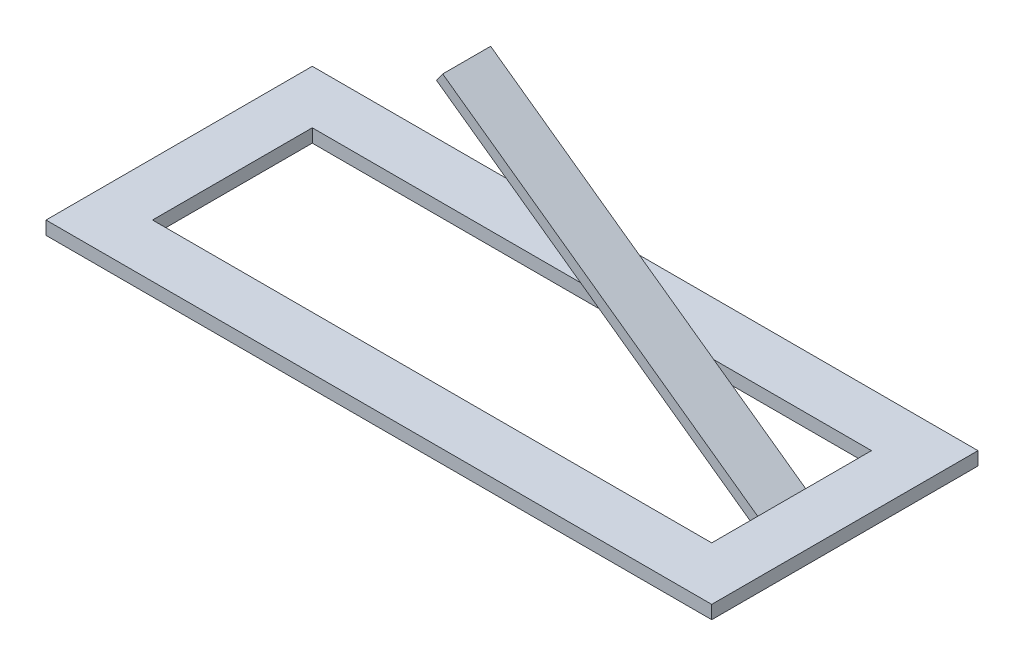
ISO-10303-21;
HEADER;
FILE_DESCRIPTION(('STEP AP214'),'2;1');
FILE_NAME('part.step','',(''),(''),'','','');
FILE_SCHEMA(('AUTOMOTIVE_DESIGN { 1 0 10303 214 1 1 1 1 }'));
ENDSEC;
DATA;
#1=APPLICATION_CONTEXT('core data for automotive mechanical design processes');
#2=APPLICATION_PROTOCOL_DEFINITION('international standard','automotive_design',2000,#1);
#3=PRODUCT_CONTEXT('',#1,'mechanical');
#4=PRODUCT('Part','Part','',(#3));
#5=PRODUCT_RELATED_PRODUCT_CATEGORY('part','',(#4));
#6=PRODUCT_DEFINITION_FORMATION('','',#4);
#7=PRODUCT_DEFINITION_CONTEXT('part definition',#1,'design');
#8=PRODUCT_DEFINITION('design','',#6,#7);
#9=PRODUCT_DEFINITION_SHAPE('','',#8);
#10=(LENGTH_UNIT() NAMED_UNIT(*) SI_UNIT(.MILLI.,.METRE.));
#11=(NAMED_UNIT(*) PLANE_ANGLE_UNIT() SI_UNIT($,.RADIAN.));
#12=(NAMED_UNIT(*) SI_UNIT($,.STERADIAN.) SOLID_ANGLE_UNIT());
#13=UNCERTAINTY_MEASURE_WITH_UNIT(LENGTH_MEASURE(1.E-05),#10,'distance_accuracy_value','');
#14=(GEOMETRIC_REPRESENTATION_CONTEXT(3) GLOBAL_UNCERTAINTY_ASSIGNED_CONTEXT((#13)) GLOBAL_UNIT_ASSIGNED_CONTEXT((#10,
#11,#12)) REPRESENTATION_CONTEXT('',''));
#15=CARTESIAN_POINT('',(0.,0.,0.));
#16=DIRECTION('',(0.,0.,1.));
#17=DIRECTION('',(1.,0.,0.));
#18=AXIS2_PLACEMENT_3D('',#15,#16,#17);
#19=CARTESIAN_POINT('',(-83.7777777777778,10.,0.));
#20=DIRECTION('',(1.,0.,0.));
#21=DIRECTION('',(0.,0.,-1.));
#22=AXIS2_PLACEMENT_3D('',#19,#20,#21);
#23=PLANE('',#22);
#24=DIRECTION('',(0.,0.,1.));
#25=VECTOR('',#24,1.);
#26=CARTESIAN_POINT('',(-83.7777777777778,5.,-117.));
#27=LINE('',#26,#25);
#28=CARTESIAN_POINT('',(-83.7777777777778,5.,-80.));
#29=VERTEX_POINT('',#28);
#30=CARTESIAN_POINT('',(-83.7777777777778,5.,20.));
#31=VERTEX_POINT('',#30);
#32=EDGE_CURVE('E58',#29,#31,#27,.T.);
#33=ORIENTED_EDGE('',*,*,#32,.T.);
#34=DIRECTION('',(0.,-1.,0.));
#35=VECTOR('',#34,1.);
#36=CARTESIAN_POINT('',(-83.7777777777778,10.,20.));
#37=LINE('',#36,#35);
#38=CARTESIAN_POINT('',(-83.7777777777778,10.,20.));
#39=VERTEX_POINT('',#38);
#40=EDGE_CURVE('E151',#39,#31,#37,.T.);
#41=ORIENTED_EDGE('',*,*,#40,.F.);
#42=DIRECTION('',(0.,0.,1.));
#43=VECTOR('',#42,1.);
#44=CARTESIAN_POINT('',(-83.7777777777778,10.,0.));
#45=LINE('',#44,#43);
#46=CARTESIAN_POINT('',(-83.7777777777778,10.,-80.));
#47=VERTEX_POINT('',#46);
#48=EDGE_CURVE('E217',#47,#39,#45,.T.);
#49=ORIENTED_EDGE('',*,*,#48,.F.);
#50=DIRECTION('',(0.,-1.,0.));
#51=VECTOR('',#50,1.);
#52=CARTESIAN_POINT('',(-83.7777777777778,10.,-80.));
#53=LINE('',#52,#51);
#54=EDGE_CURVE('E160',#47,#29,#53,.T.);
#55=ORIENTED_EDGE('',*,*,#54,.T.);
#56=EDGE_LOOP('',(#33,#41,#49,#55));
#57=FACE_BOUND('',#56,.T.);
#58=ADVANCED_FACE('F43',(#57),#23,.F.);
#59=CARTESIAN_POINT('',(0.,10.,20.));
#60=DIRECTION('',(0.,0.,-1.));
#61=DIRECTION('',(-1.,0.,0.));
#62=AXIS2_PLACEMENT_3D('',#59,#60,#61);
#63=PLANE('',#62);
#64=DIRECTION('',(1.,0.,0.));
#65=VECTOR('',#64,1.);
#66=CARTESIAN_POINT('',(-83.7777777777778,5.,20.));
#67=LINE('',#66,#65);
#68=CARTESIAN_POINT('',(166.222222222222,5.,20.));
#69=VERTEX_POINT('',#68);
#70=EDGE_CURVE('E138',#31,#69,#67,.T.);
#71=ORIENTED_EDGE('',*,*,#70,.T.);
#72=DIRECTION('',(0.,-1.,0.));
#73=VECTOR('',#72,1.);
#74=CARTESIAN_POINT('',(166.222222222222,10.,20.));
#75=LINE('',#74,#73);
#76=CARTESIAN_POINT('',(166.222222222222,10.,20.));
#77=VERTEX_POINT('',#76);
#78=EDGE_CURVE('E148',#77,#69,#75,.T.);
#79=ORIENTED_EDGE('',*,*,#78,.F.);
#80=DIRECTION('',(1.,0.,0.));
#81=VECTOR('',#80,1.);
#82=CARTESIAN_POINT('',(0.,10.,20.));
#83=LINE('',#82,#81);
#84=EDGE_CURVE('E220',#39,#77,#83,.T.);
#85=ORIENTED_EDGE('',*,*,#84,.F.);
#86=ORIENTED_EDGE('',*,*,#40,.T.);
#87=EDGE_LOOP('',(#71,#79,#85,#86));
#88=FACE_BOUND('',#87,.T.);
#89=ADVANCED_FACE('F147',(#88),#63,.F.);
#90=CARTESIAN_POINT('',(166.222222222222,10.,0.));
#91=DIRECTION('',(1.,0.,0.));
#92=DIRECTION('',(0.,0.,-1.));
#93=AXIS2_PLACEMENT_3D('',#90,#91,#92);
#94=PLANE('',#93);
#95=ORIENTED_EDGE('',*,*,#78,.T.);
#96=DIRECTION('',(0.,0.,1.));
#97=VECTOR('',#96,1.);
#98=CARTESIAN_POINT('',(166.222222222222,5.,-117.));
#99=LINE('',#98,#97);
#100=CARTESIAN_POINT('',(166.222222222222,5.,-80.));
#101=VERTEX_POINT('',#100);
#102=EDGE_CURVE('E135',#101,#69,#99,.T.);
#103=ORIENTED_EDGE('',*,*,#102,.F.);
#104=DIRECTION('',(0.,-1.,0.));
#105=VECTOR('',#104,1.);
#106=CARTESIAN_POINT('',(166.222222222222,10.,-80.));
#107=LINE('',#106,#105);
#108=CARTESIAN_POINT('',(166.222222222222,10.,-80.));
#109=VERTEX_POINT('',#108);
#110=EDGE_CURVE('E156',#109,#101,#107,.T.);
#111=ORIENTED_EDGE('',*,*,#110,.F.);
#112=DIRECTION('',(0.,0.,1.));
#113=VECTOR('',#112,1.);
#114=CARTESIAN_POINT('',(166.222222222222,10.,0.));
#115=LINE('',#114,#113);
#116=EDGE_CURVE('E155',#109,#77,#115,.T.);
#117=ORIENTED_EDGE('',*,*,#116,.T.);
#118=EDGE_LOOP('',(#95,#103,#111,#117));
#119=FACE_BOUND('',#118,.T.);
#120=ADVANCED_FACE('F153',(#119),#94,.T.);
#121=CARTESIAN_POINT('',(0.,10.,0.));
#122=DIRECTION('',(0.,0.,1.));
#123=DIRECTION('',(1.,0.,0.));
#124=AXIS2_PLACEMENT_3D('',#121,#122,#123);
#125=PLANE('',#124);
#126=DIRECTION('',(1.,0.,0.));
#127=VECTOR('',#126,1.);
#128=CARTESIAN_POINT('',(0.,5.,0.));
#129=LINE('',#128,#127);
#130=CARTESIAN_POINT('',(-63.7777777777778,5.,0.));
#131=VERTEX_POINT('',#130);
#132=CARTESIAN_POINT('',(146.222222222222,5.,0.));
#133=VERTEX_POINT('',#132);
#134=EDGE_CURVE('E231',#131,#133,#129,.T.);
#135=ORIENTED_EDGE('',*,*,#134,.F.);
#136=DIRECTION('',(0.,-1.,0.));
#137=VECTOR('',#136,1.);
#138=CARTESIAN_POINT('',(-63.7777777777778,10.,0.));
#139=LINE('',#138,#137);
#140=CARTESIAN_POINT('',(-63.7777777777778,10.,0.));
#141=VERTEX_POINT('',#140);
#142=EDGE_CURVE('E174',#141,#131,#139,.T.);
#143=ORIENTED_EDGE('',*,*,#142,.F.);
#144=DIRECTION('',(-1.,0.,0.));
#145=VECTOR('',#144,1.);
#146=CARTESIAN_POINT('',(0.,10.,0.));
#147=LINE('',#146,#145);
#148=CARTESIAN_POINT('',(146.222222222222,10.,0.));
#149=VERTEX_POINT('',#148);
#150=EDGE_CURVE('E207',#149,#141,#147,.T.);
#151=ORIENTED_EDGE('',*,*,#150,.F.);
#152=DIRECTION('',(0.,-1.,0.));
#153=VECTOR('',#152,1.);
#154=CARTESIAN_POINT('',(146.222222222222,10.,0.));
#155=LINE('',#154,#153);
#156=EDGE_CURVE('E164',#149,#133,#155,.T.);
#157=ORIENTED_EDGE('',*,*,#156,.T.);
#158=EDGE_LOOP('',(#135,#143,#151,#157));
#159=FACE_BOUND('',#158,.T.);
#160=ADVANCED_FACE('F45',(#159),#125,.F.);
#161=CARTESIAN_POINT('',(-63.7777777777778,10.,0.));
#162=DIRECTION('',(1.,0.,0.));
#163=DIRECTION('',(0.,0.,-1.));
#164=AXIS2_PLACEMENT_3D('',#161,#162,#163);
#165=PLANE('',#164);
#166=ORIENTED_EDGE('',*,*,#142,.T.);
#167=DIRECTION('',(0.,0.,-1.));
#168=VECTOR('',#167,1.);
#169=CARTESIAN_POINT('',(-63.7777777777778,5.,0.));
#170=LINE('',#169,#168);
#171=CARTESIAN_POINT('',(-63.7777777777778,5.,-60.0000000000002));
#172=VERTEX_POINT('',#171);
#173=EDGE_CURVE('E234',#131,#172,#170,.T.);
#174=ORIENTED_EDGE('',*,*,#173,.T.);
#175=DIRECTION('',(0.,-1.,0.));
#176=VECTOR('',#175,1.);
#177=CARTESIAN_POINT('',(-63.7777777777778,10.,-60.0000000000001));
#178=LINE('',#177,#176);
#179=CARTESIAN_POINT('',(-63.7777777777778,10.,-60.0000000000001));
#180=VERTEX_POINT('',#179);
#181=EDGE_CURVE('E171',#180,#172,#178,.T.);
#182=ORIENTED_EDGE('',*,*,#181,.F.);
#183=DIRECTION('',(0.,0.,1.));
#184=VECTOR('',#183,1.);
#185=CARTESIAN_POINT('',(-63.7777777777778,10.,0.));
#186=LINE('',#185,#184);
#187=EDGE_CURVE('E209',#180,#141,#186,.T.);
#188=ORIENTED_EDGE('',*,*,#187,.T.);
#189=EDGE_LOOP('',(#166,#174,#182,#188));
#190=FACE_BOUND('',#189,.T.);
#191=ADVANCED_FACE('F268',(#190),#165,.T.);
#192=CARTESIAN_POINT('',(0.,10.,-60.0000000000001));
#193=DIRECTION('',(0.,0.,1.));
#194=DIRECTION('',(1.,0.,0.));
#195=AXIS2_PLACEMENT_3D('',#192,#193,#194);
#196=PLANE('',#195);
#197=ORIENTED_EDGE('',*,*,#181,.T.);
#198=DIRECTION('',(1.,0.,0.));
#199=VECTOR('',#198,1.);
#200=CARTESIAN_POINT('',(0.,5.,-60.0000000000001));
#201=LINE('',#200,#199);
#202=CARTESIAN_POINT('',(146.222222222222,5.,-60.));
#203=VERTEX_POINT('',#202);
#204=EDGE_CURVE('E262',#172,#203,#201,.T.);
#205=ORIENTED_EDGE('',*,*,#204,.T.);
#206=DIRECTION('',(0.,-1.,0.));
#207=VECTOR('',#206,1.);
#208=CARTESIAN_POINT('',(146.222222222222,10.,-60.));
#209=LINE('',#208,#207);
#210=CARTESIAN_POINT('',(146.222222222222,10.,-60.));
#211=VERTEX_POINT('',#210);
#212=EDGE_CURVE('E167',#211,#203,#209,.T.);
#213=ORIENTED_EDGE('',*,*,#212,.F.);
#214=DIRECTION('',(-1.,0.,0.));
#215=VECTOR('',#214,1.);
#216=CARTESIAN_POINT('',(0.,10.,-60.0000000000001));
#217=LINE('',#216,#215);
#218=EDGE_CURVE('E212',#211,#180,#217,.T.);
#219=ORIENTED_EDGE('',*,*,#218,.T.);
#220=EDGE_LOOP('',(#197,#205,#213,#219));
#221=FACE_BOUND('',#220,.T.);
#222=ADVANCED_FACE('F273',(#221),#196,.T.);
#223=CARTESIAN_POINT('',(146.222222222222,10.,0.));
#224=DIRECTION('',(1.,0.,0.));
#225=DIRECTION('',(0.,0.,-1.));
#226=AXIS2_PLACEMENT_3D('',#223,#224,#225);
#227=PLANE('',#226);
#228=DIRECTION('',(0.,0.,-1.));
#229=VECTOR('',#228,1.);
#230=CARTESIAN_POINT('',(146.222222222222,5.,0.));
#231=LINE('',#230,#229);
#232=CARTESIAN_POINT('',(146.222222222222,5.,-18.));
#233=VERTEX_POINT('',#232);
#234=EDGE_CURVE('E66',#133,#233,#231,.T.);
#235=ORIENTED_EDGE('',*,*,#234,.F.);
#236=ORIENTED_EDGE('',*,*,#156,.F.);
#237=DIRECTION('',(0.,0.,1.));
#238=VECTOR('',#237,1.);
#239=CARTESIAN_POINT('',(146.222222222222,10.,0.));
#240=LINE('',#239,#238);
#241=EDGE_CURVE('E215',#211,#149,#240,.T.);
#242=ORIENTED_EDGE('',*,*,#241,.F.);
#243=ORIENTED_EDGE('',*,*,#212,.T.);
#244=CARTESIAN_POINT('',(146.222222222222,5.,-36.));
#245=VERTEX_POINT('',#244);
#246=EDGE_CURVE('E258',#245,#203,#231,.T.);
#247=ORIENTED_EDGE('',*,*,#246,.F.);
#248=DIRECTION('',(0.,1.,0.));
#249=VECTOR('',#248,1.);
#250=CARTESIAN_POINT('',(146.222222222222,10.,-36.));
#251=LINE('',#250,#249);
#252=CARTESIAN_POINT('',(146.222222222222,8.77207494611245,-36.));
#253=VERTEX_POINT('',#252);
#254=EDGE_CURVE('E158',#245,#253,#251,.T.);
#255=ORIENTED_EDGE('',*,*,#254,.T.);
#256=DIRECTION('',(0.,0.,1.));
#257=VECTOR('',#256,1.);
#258=CARTESIAN_POINT('',(146.222222222222,8.77207494611245,0.));
#259=LINE('',#258,#257);
#260=CARTESIAN_POINT('',(146.222222222222,8.77207494611245,-18.));
#261=VERTEX_POINT('',#260);
#262=EDGE_CURVE('E200',#253,#261,#259,.T.);
#263=ORIENTED_EDGE('',*,*,#262,.T.);
#264=DIRECTION('',(0.,1.,0.));
#265=VECTOR('',#264,1.);
#266=CARTESIAN_POINT('',(146.222222222222,-36.,-18.));
#267=LINE('',#266,#265);
#268=EDGE_CURVE('E230',#233,#261,#267,.T.);
#269=ORIENTED_EDGE('',*,*,#268,.F.);
#270=EDGE_LOOP('',(#235,#236,#242,#243,#247,#255,#263,#269));
#271=FACE_BOUND('',#270,.T.);
#272=ADVANCED_FACE('F255',(#271),#227,.F.);
#273=CARTESIAN_POINT('',(0.,10.,-80.));
#274=DIRECTION('',(0.,0.,-1.));
#275=DIRECTION('',(-1.,0.,0.));
#276=AXIS2_PLACEMENT_3D('',#273,#274,#275);
#277=PLANE('',#276);
#278=ORIENTED_EDGE('',*,*,#110,.T.);
#279=DIRECTION('',(-1.,0.,0.));
#280=VECTOR('',#279,1.);
#281=CARTESIAN_POINT('',(0.,5.,-80.));
#282=LINE('',#281,#280);
#283=EDGE_CURVE('E139',#101,#29,#282,.T.);
#284=ORIENTED_EDGE('',*,*,#283,.T.);
#285=ORIENTED_EDGE('',*,*,#54,.F.);
#286=DIRECTION('',(1.,0.,0.));
#287=VECTOR('',#286,1.);
#288=CARTESIAN_POINT('',(0.,10.,-80.));
#289=LINE('',#288,#287);
#290=EDGE_CURVE('E168',#47,#109,#289,.T.);
#291=ORIENTED_EDGE('',*,*,#290,.T.);
#292=EDGE_LOOP('',(#278,#284,#285,#291));
#293=FACE_BOUND('',#292,.T.);
#294=ADVANCED_FACE('F229',(#293),#277,.T.);
#295=CARTESIAN_POINT('',(0.,0.,-36.));
#296=DIRECTION('',(0.,0.,-1.));
#297=DIRECTION('',(-1.,0.,0.));
#298=AXIS2_PLACEMENT_3D('',#295,#296,#297);
#299=PLANE('',#298);
#300=ORIENTED_EDGE('',*,*,#254,.F.);
#301=DIRECTION('',(-1.,0.,0.));
#302=VECTOR('',#301,1.);
#303=CARTESIAN_POINT('',(0.,5.,-36.));
#304=LINE('',#303,#302);
#305=CARTESIAN_POINT('',(144.619477723049,5.00000000000002,-36.));
#306=VERTEX_POINT('',#305);
#307=EDGE_CURVE('E247',#245,#306,#304,.T.);
#308=ORIENTED_EDGE('',*,*,#307,.T.);
#309=DIRECTION('',(0.813054204662094,-0.582187993934339,0.));
#310=VECTOR('',#309,1.);
#311=CARTESIAN_POINT('',(24.8696626536189,90.7469332419899,-36.));
#312=LINE('',#311,#310);
#313=CARTESIAN_POINT('',(24.8696626536189,90.7469332419899,-36.));
#314=VERTEX_POINT('',#313);
#315=EDGE_CURVE('E198',#314,#306,#312,.T.);
#316=ORIENTED_EDGE('',*,*,#315,.F.);
#317=DIRECTION('',(-0.582187993934339,-0.813054204662094,0.));
#318=VECTOR('',#317,1.);
#319=CARTESIAN_POINT('',(27.1984146293562,93.9991500606383,-36.));
#320=LINE('',#319,#318);
#321=CARTESIAN_POINT('',(27.1984146293562,93.9991500606383,-36.));
#322=VERTEX_POINT('',#321);
#323=EDGE_CURVE('E203',#322,#314,#320,.T.);
#324=ORIENTED_EDGE('',*,*,#323,.F.);
#325=DIRECTION('',(-0.813054204662094,0.582187993934339,0.));
#326=VECTOR('',#325,1.);
#327=CARTESIAN_POINT('',(155.307951764649,2.26623237693957,-36.));
#328=LINE('',#327,#326);
#329=EDGE_CURVE('E197',#253,#322,#328,.T.);
#330=ORIENTED_EDGE('',*,*,#329,.F.);
#331=EDGE_LOOP('',(#300,#308,#316,#324,#330));
#332=FACE_BOUND('',#331,.T.);
#333=ADVANCED_FACE('F246',(#332),#299,.T.);
#334=CARTESIAN_POINT('',(24.8696626536189,90.7469332419899,-36.));
#335=DIRECTION('',(-0.582187993934339,-0.813054204662094,0.));
#336=DIRECTION('',(0.813054204662094,-0.582187993934339,0.));
#337=AXIS2_PLACEMENT_3D('',#334,#335,#336);
#338=PLANE('',#337);
#339=ORIENTED_EDGE('',*,*,#315,.T.);
#340=DIRECTION('',(0.,0.,1.));
#341=VECTOR('',#340,1.);
#342=CARTESIAN_POINT('',(144.619477723049,5.00000000000002,-36.));
#343=LINE('',#342,#341);
#344=CARTESIAN_POINT('',(144.619477723049,5.00000000000001,-18.));
#345=VERTEX_POINT('',#344);
#346=EDGE_CURVE('E251',#306,#345,#343,.T.);
#347=ORIENTED_EDGE('',*,*,#346,.T.);
#348=DIRECTION('',(-0.813054204662094,0.582187993934339,0.));
#349=VECTOR('',#348,1.);
#350=CARTESIAN_POINT('',(24.8696626536189,90.7469332419899,-18.));
#351=LINE('',#350,#349);
#352=CARTESIAN_POINT('',(24.8696626536189,90.7469332419899,-18.));
#353=VERTEX_POINT('',#352);
#354=EDGE_CURVE('E239',#345,#353,#351,.T.);
#355=ORIENTED_EDGE('',*,*,#354,.T.);
#356=DIRECTION('',(0.,0.,1.));
#357=VECTOR('',#356,1.);
#358=CARTESIAN_POINT('',(24.8696626536189,90.7469332419899,-36.));
#359=LINE('',#358,#357);
#360=EDGE_CURVE('E187',#314,#353,#359,.T.);
#361=ORIENTED_EDGE('',*,*,#360,.F.);
#362=EDGE_LOOP('',(#339,#347,#355,#361));
#363=FACE_BOUND('',#362,.T.);
#364=ADVANCED_FACE('F250',(#363),#338,.T.);
#365=CARTESIAN_POINT('',(0.,0.,-18.));
#366=DIRECTION('',(0.,0.,1.));
#367=DIRECTION('',(1.,0.,0.));
#368=AXIS2_PLACEMENT_3D('',#365,#366,#367);
#369=PLANE('',#368);
#370=ORIENTED_EDGE('',*,*,#354,.F.);
#371=DIRECTION('',(1.,0.,0.));
#372=VECTOR('',#371,1.);
#373=CARTESIAN_POINT('',(0.,5.,-18.));
#374=LINE('',#373,#372);
#375=EDGE_CURVE('E11',#345,#233,#374,.T.);
#376=ORIENTED_EDGE('',*,*,#375,.T.);
#377=ORIENTED_EDGE('',*,*,#268,.T.);
#378=DIRECTION('',(0.813054204662094,-0.582187993934339,0.));
#379=VECTOR('',#378,1.);
#380=CARTESIAN_POINT('',(155.307951764649,2.26623237693957,-18.));
#381=LINE('',#380,#379);
#382=CARTESIAN_POINT('',(27.1984146293562,93.9991500606383,-18.));
#383=VERTEX_POINT('',#382);
#384=EDGE_CURVE('E194',#383,#261,#381,.T.);
#385=ORIENTED_EDGE('',*,*,#384,.F.);
#386=DIRECTION('',(0.582187993934339,0.813054204662094,0.));
#387=VECTOR('',#386,1.);
#388=CARTESIAN_POINT('',(27.1984146293562,93.9991500606383,-18.));
#389=LINE('',#388,#387);
#390=EDGE_CURVE('E51',#353,#383,#389,.T.);
#391=ORIENTED_EDGE('',*,*,#390,.F.);
#392=EDGE_LOOP('',(#370,#376,#377,#385,#391));
#393=FACE_BOUND('',#392,.T.);
#394=ADVANCED_FACE('F252',(#393),#369,.T.);
#395=CARTESIAN_POINT('',(27.1984146293562,93.9991500606383,-36.));
#396=DIRECTION('',(-0.813054204662094,0.582187993934339,0.));
#397=DIRECTION('',(-0.582187993934339,-0.813054204662094,0.));
#398=AXIS2_PLACEMENT_3D('',#395,#396,#397);
#399=PLANE('',#398);
#400=ORIENTED_EDGE('',*,*,#360,.T.);
#401=ORIENTED_EDGE('',*,*,#390,.T.);
#402=DIRECTION('',(0.,0.,1.));
#403=VECTOR('',#402,1.);
#404=CARTESIAN_POINT('',(27.1984146293562,93.9991500606383,-36.));
#405=LINE('',#404,#403);
#406=EDGE_CURVE('E185',#322,#383,#405,.T.);
#407=ORIENTED_EDGE('',*,*,#406,.F.);
#408=ORIENTED_EDGE('',*,*,#323,.T.);
#409=EDGE_LOOP('',(#400,#401,#407,#408));
#410=FACE_BOUND('',#409,.T.);
#411=ADVANCED_FACE('F183',(#410),#399,.T.);
#412=CARTESIAN_POINT('',(0.,10.,0.));
#413=DIRECTION('',(0.,1.,0.));
#414=DIRECTION('',(0.,0.,1.));
#415=AXIS2_PLACEMENT_3D('',#412,#413,#414);
#416=PLANE('',#415);
#417=ORIENTED_EDGE('',*,*,#150,.T.);
#418=ORIENTED_EDGE('',*,*,#187,.F.);
#419=ORIENTED_EDGE('',*,*,#218,.F.);
#420=ORIENTED_EDGE('',*,*,#241,.T.);
#421=EDGE_LOOP('',(#417,#418,#419,#420));
#422=FACE_BOUND('',#421,.T.);
#423=ORIENTED_EDGE('',*,*,#48,.T.);
#424=ORIENTED_EDGE('',*,*,#84,.T.);
#425=ORIENTED_EDGE('',*,*,#116,.F.);
#426=ORIENTED_EDGE('',*,*,#290,.F.);
#427=EDGE_LOOP('',(#423,#424,#425,#426));
#428=FACE_BOUND('',#427,.T.);
#429=ADVANCED_FACE('F276',(#422,#428),#416,.T.);
#430=CARTESIAN_POINT('',(155.307951764649,2.26623237693957,-36.));
#431=DIRECTION('',(0.582187993934339,0.813054204662094,0.));
#432=DIRECTION('',(-0.813054204662094,0.582187993934339,0.));
#433=AXIS2_PLACEMENT_3D('',#430,#431,#432);
#434=PLANE('',#433);
#435=ORIENTED_EDGE('',*,*,#384,.T.);
#436=ORIENTED_EDGE('',*,*,#262,.F.);
#437=ORIENTED_EDGE('',*,*,#329,.T.);
#438=ORIENTED_EDGE('',*,*,#406,.T.);
#439=EDGE_LOOP('',(#435,#436,#437,#438));
#440=FACE_BOUND('',#439,.T.);
#441=ADVANCED_FACE('F192',(#440),#434,.T.);
#442=CARTESIAN_POINT('',(-83.7777777777778,5.,-117.));
#443=DIRECTION('',(0.,-1.,0.));
#444=DIRECTION('',(0.,0.,-1.));
#445=AXIS2_PLACEMENT_3D('',#442,#443,#444);
#446=PLANE('',#445);
#447=ORIENTED_EDGE('',*,*,#102,.T.);
#448=ORIENTED_EDGE('',*,*,#70,.F.);
#449=ORIENTED_EDGE('',*,*,#32,.F.);
#450=ORIENTED_EDGE('',*,*,#283,.F.);
#451=EDGE_LOOP('',(#447,#448,#449,#450));
#452=FACE_BOUND('',#451,.T.);
#453=ORIENTED_EDGE('',*,*,#134,.T.);
#454=ORIENTED_EDGE('',*,*,#234,.T.);
#455=ORIENTED_EDGE('',*,*,#375,.F.);
#456=ORIENTED_EDGE('',*,*,#346,.F.);
#457=ORIENTED_EDGE('',*,*,#307,.F.);
#458=ORIENTED_EDGE('',*,*,#246,.T.);
#459=ORIENTED_EDGE('',*,*,#204,.F.);
#460=ORIENTED_EDGE('',*,*,#173,.F.);
#461=EDGE_LOOP('',(#453,#454,#455,#456,#457,#458,#459,#460));
#462=FACE_BOUND('',#461,.T.);
#463=ADVANCED_FACE('F137',(#452,#462),#446,.T.);
#464=CLOSED_SHELL('',(#58,#89,#120,#160,#191,#222,#272,#294,#333,#364,#394,#411,#429,#441,#463));
#465=MANIFOLD_SOLID_BREP('B2',#464);
#466=ADVANCED_BREP_SHAPE_REPRESENTATION('',(#18,#465),#14);
#467=SHAPE_DEFINITION_REPRESENTATION(#9,#466);
ENDSEC;
END-ISO-10303-21;
